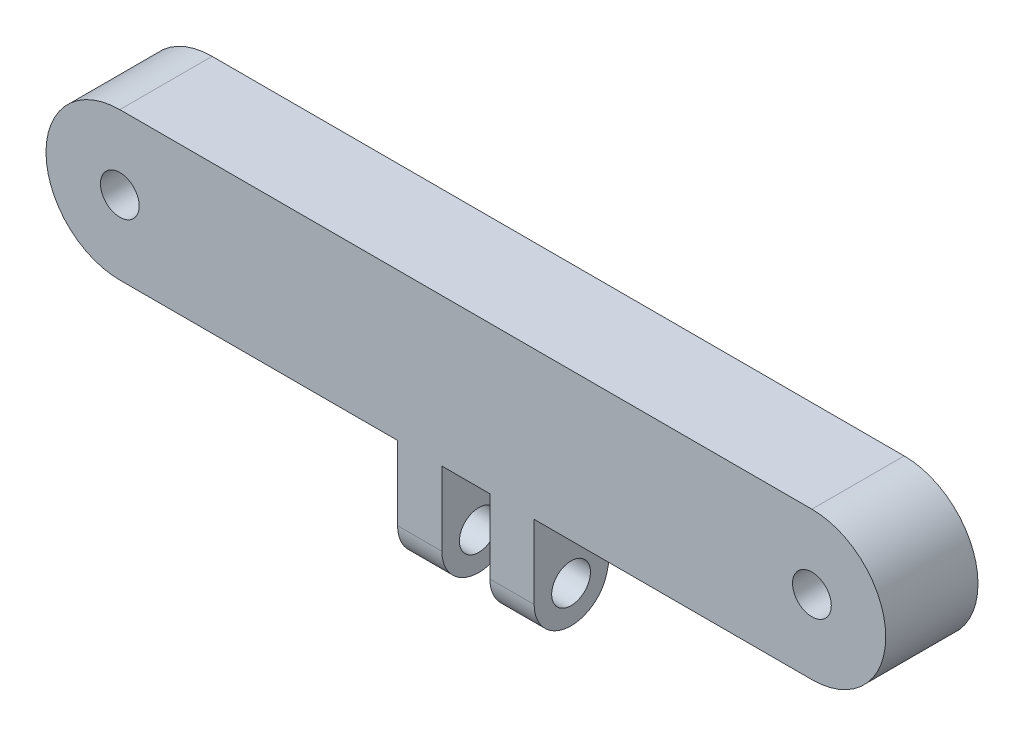
ISO-10303-21;
HEADER;
FILE_DESCRIPTION(('STEP AP214'),'2;1');
FILE_NAME('part.step','',(''),(''),'','','');
FILE_SCHEMA(('AUTOMOTIVE_DESIGN { 1 0 10303 214 1 1 1 1 }'));
ENDSEC;
DATA;
#1=APPLICATION_CONTEXT('core data for automotive mechanical design processes');
#2=APPLICATION_PROTOCOL_DEFINITION('international standard','automotive_design',2000,#1);
#3=PRODUCT_CONTEXT('',#1,'mechanical');
#4=PRODUCT('Part','Part','',(#3));
#5=PRODUCT_RELATED_PRODUCT_CATEGORY('part','',(#4));
#6=PRODUCT_DEFINITION_FORMATION('','',#4);
#7=PRODUCT_DEFINITION_CONTEXT('part definition',#1,'design');
#8=PRODUCT_DEFINITION('design','',#6,#7);
#9=PRODUCT_DEFINITION_SHAPE('','',#8);
#10=(LENGTH_UNIT() NAMED_UNIT(*) SI_UNIT(.MILLI.,.METRE.));
#11=(NAMED_UNIT(*) PLANE_ANGLE_UNIT() SI_UNIT($,.RADIAN.));
#12=(NAMED_UNIT(*) SI_UNIT($,.STERADIAN.) SOLID_ANGLE_UNIT());
#13=UNCERTAINTY_MEASURE_WITH_UNIT(LENGTH_MEASURE(1.E-05),#10,'distance_accuracy_value','');
#14=(GEOMETRIC_REPRESENTATION_CONTEXT(3) GLOBAL_UNCERTAINTY_ASSIGNED_CONTEXT((#13)) GLOBAL_UNIT_ASSIGNED_CONTEXT((#10,
#11,#12)) REPRESENTATION_CONTEXT('',''));
#15=CARTESIAN_POINT('',(0.,0.,0.));
#16=DIRECTION('',(0.,0.,1.));
#17=DIRECTION('',(1.,0.,0.));
#18=AXIS2_PLACEMENT_3D('',#15,#16,#17);
#19=CARTESIAN_POINT('',(7.4,-16.,6.));
#20=DIRECTION('',(-1.,0.,0.));
#21=DIRECTION('',(0.,0.,1.));
#22=AXIS2_PLACEMENT_3D('',#19,#20,#21);
#23=CYLINDRICAL_SURFACE('',#22,4.);
#24=DIRECTION('',(-1.,0.,0.));
#25=VECTOR('',#24,1.);
#26=CARTESIAN_POINT('',(7.4,-16.9196363335788,2.10715155522826));
#27=LINE('',#26,#25);
#28=CARTESIAN_POINT('',(-2.6,-16.9196363335788,2.10715155522826));
#29=VERTEX_POINT('',#28);
#30=CARTESIAN_POINT('',(-7.4,-16.9196363335788,2.10715155522826));
#31=VERTEX_POINT('',#30);
#32=EDGE_CURVE('E198',#29,#31,#27,.T.);
#33=ORIENTED_EDGE('',*,*,#32,.F.);
#34=CARTESIAN_POINT('',(-2.6,-16.,6.));
#35=DIRECTION('',(-1.,0.,0.));
#36=DIRECTION('',(0.,-1.,0.));
#37=AXIS2_PLACEMENT_3D('',#34,#35,#36);
#38=CIRCLE('',#37,4.);
#39=CARTESIAN_POINT('',(-2.6,-16.,10.));
#40=VERTEX_POINT('',#39);
#41=EDGE_CURVE('E330',#29,#40,#38,.T.);
#42=ORIENTED_EDGE('',*,*,#41,.T.);
#43=DIRECTION('',(-1.,0.,0.));
#44=VECTOR('',#43,1.);
#45=CARTESIAN_POINT('',(7.4,-16.,10.));
#46=LINE('',#45,#44);
#47=CARTESIAN_POINT('',(-7.4,-16.,10.));
#48=VERTEX_POINT('',#47);
#49=EDGE_CURVE('E210',#40,#48,#46,.T.);
#50=ORIENTED_EDGE('',*,*,#49,.T.);
#51=CARTESIAN_POINT('',(-7.4,-16.,6.));
#52=DIRECTION('',(1.,0.,0.));
#53=DIRECTION('',(0.,0.,-1.));
#54=AXIS2_PLACEMENT_3D('',#51,#52,#53);
#55=CIRCLE('',#54,4.);
#56=EDGE_CURVE('E361',#48,#31,#55,.T.);
#57=ORIENTED_EDGE('',*,*,#56,.T.);
#58=EDGE_LOOP('',(#33,#42,#50,#57));
#59=FACE_BOUND('',#58,.T.);
#60=ADVANCED_FACE('F45',(#59),#23,.T.);
#61=CARTESIAN_POINT('',(7.4,-16.9196363335788,2.10715155522826));
#62=DIRECTION('',(0.,0.229909083394701,0.973212111192934));
#63=DIRECTION('',(0.,-0.973212111192934,0.229909083394701));
#64=AXIS2_PLACEMENT_3D('',#61,#62,#63);
#65=PLANE('',#64);
#66=DIRECTION('',(-1.,0.,0.));
#67=VECTOR('',#66,1.);
#68=CARTESIAN_POINT('',(7.4,-7.99999999999999,0.));
#69=LINE('',#68,#67);
#70=CARTESIAN_POINT('',(-2.6,-7.99999999999999,0.));
#71=VERTEX_POINT('',#70);
#72=CARTESIAN_POINT('',(-7.4,-7.99999999999999,0.));
#73=VERTEX_POINT('',#72);
#74=EDGE_CURVE('E199',#71,#73,#69,.T.);
#75=ORIENTED_EDGE('',*,*,#74,.F.);
#76=DIRECTION('',(0.,-0.973212111192934,0.229909083394701));
#77=VECTOR('',#76,1.);
#78=CARTESIAN_POINT('',(-2.6,-16.9196363335788,2.10715155522826));
#79=LINE('',#78,#77);
#80=EDGE_CURVE('E326',#71,#29,#79,.T.);
#81=ORIENTED_EDGE('',*,*,#80,.T.);
#82=ORIENTED_EDGE('',*,*,#32,.T.);
#83=DIRECTION('',(0.,0.973212111192934,-0.229909083394701));
#84=VECTOR('',#83,1.);
#85=CARTESIAN_POINT('',(-7.4,-16.9196363335788,2.10715155522826));
#86=LINE('',#85,#84);
#87=EDGE_CURVE('E206',#31,#73,#86,.T.);
#88=ORIENTED_EDGE('',*,*,#87,.T.);
#89=EDGE_LOOP('',(#75,#81,#82,#88));
#90=FACE_BOUND('',#89,.T.);
#91=ADVANCED_FACE('F373',(#90),#65,.F.);
#92=CARTESIAN_POINT('',(7.4,-16.,6.));
#93=DIRECTION('',(-1.,0.,0.));
#94=DIRECTION('',(0.,0.,1.));
#95=AXIS2_PLACEMENT_3D('',#92,#93,#94);
#96=CYLINDRICAL_SURFACE('',#95,2.1);
#97=CARTESIAN_POINT('',(-2.6,-16.,6.));
#98=DIRECTION('',(-1.,0.,0.));
#99=DIRECTION('',(0.,-1.,0.));
#100=AXIS2_PLACEMENT_3D('',#97,#98,#99);
#101=CIRCLE('',#100,2.1);
#102=CARTESIAN_POINT('',(-2.6,-18.1,6.));
#103=VERTEX_POINT('',#102);
#104=EDGE_CURVE('E49',#103,#103,#101,.T.);
#105=ORIENTED_EDGE('',*,*,#104,.F.);
#106=EDGE_LOOP('',(#105));
#107=FACE_BOUND('',#106,.T.);
#108=CARTESIAN_POINT('',(-7.4,-16.,6.));
#109=DIRECTION('',(1.,0.,0.));
#110=DIRECTION('',(0.,0.,-1.));
#111=AXIS2_PLACEMENT_3D('',#108,#109,#110);
#112=CIRCLE('',#111,2.1);
#113=CARTESIAN_POINT('',(-7.4,-16.,3.9));
#114=VERTEX_POINT('',#113);
#115=EDGE_CURVE('E334',#114,#114,#112,.T.);
#116=ORIENTED_EDGE('',*,*,#115,.F.);
#117=EDGE_LOOP('',(#116));
#118=FACE_BOUND('',#117,.T.);
#119=ADVANCED_FACE('F417',(#107,#118),#96,.F.);
#120=CARTESIAN_POINT('',(-37.5,-8.,10.));
#121=DIRECTION('',(0.,1.,0.));
#122=DIRECTION('',(-1.,0.,0.));
#123=AXIS2_PLACEMENT_3D('',#120,#121,#122);
#124=PLANE('',#123);
#125=DIRECTION('',(0.,0.,1.));
#126=VECTOR('',#125,1.);
#127=CARTESIAN_POINT('',(-7.4,-7.99999999999999,0.));
#128=LINE('',#127,#126);
#129=CARTESIAN_POINT('',(-7.4,-7.99999999999999,10.));
#130=VERTEX_POINT('',#129);
#131=EDGE_CURVE('E339',#73,#130,#128,.T.);
#132=ORIENTED_EDGE('',*,*,#131,.T.);
#133=DIRECTION('',(1.,0.,0.));
#134=VECTOR('',#133,1.);
#135=CARTESIAN_POINT('',(-37.5,-8.,10.));
#136=LINE('',#135,#134);
#137=CARTESIAN_POINT('',(-37.5,-8.,10.));
#138=VERTEX_POINT('',#137);
#139=EDGE_CURVE('E282',#138,#130,#136,.T.);
#140=ORIENTED_EDGE('',*,*,#139,.F.);
#141=DIRECTION('',(0.,0.,-1.));
#142=VECTOR('',#141,1.);
#143=CARTESIAN_POINT('',(-37.5,-8.,10.));
#144=LINE('',#143,#142);
#145=CARTESIAN_POINT('',(-37.5,-8.,0.));
#146=VERTEX_POINT('',#145);
#147=EDGE_CURVE('E11',#138,#146,#144,.T.);
#148=ORIENTED_EDGE('',*,*,#147,.T.);
#149=DIRECTION('',(1.,0.,0.));
#150=VECTOR('',#149,1.);
#151=CARTESIAN_POINT('',(-37.5,-8.,0.));
#152=LINE('',#151,#150);
#153=EDGE_CURVE('E296',#146,#73,#152,.T.);
#154=ORIENTED_EDGE('',*,*,#153,.T.);
#155=EDGE_LOOP('',(#132,#140,#148,#154));
#156=FACE_BOUND('',#155,.T.);
#157=ADVANCED_FACE('F379',(#156),#124,.F.);
#158=CARTESIAN_POINT('',(-37.5,0.,10.));
#159=DIRECTION('',(0.,0.,1.));
#160=DIRECTION('',(1.,0.,0.));
#161=AXIS2_PLACEMENT_3D('',#158,#159,#160);
#162=PLANE('',#161);
#163=DIRECTION('',(0.,-1.,0.));
#164=VECTOR('',#163,1.);
#165=CARTESIAN_POINT('',(-2.6,-8.,10.));
#166=LINE('',#165,#164);
#167=CARTESIAN_POINT('',(-2.6,-8.,10.));
#168=VERTEX_POINT('',#167);
#169=EDGE_CURVE('E400',#168,#40,#166,.T.);
#170=ORIENTED_EDGE('',*,*,#169,.F.);
#171=DIRECTION('',(-1.,0.,0.));
#172=VECTOR('',#171,1.);
#173=CARTESIAN_POINT('',(-2.6,-8.,10.));
#174=LINE('',#173,#172);
#175=CARTESIAN_POINT('',(2.6,-8.,10.));
#176=VERTEX_POINT('',#175);
#177=EDGE_CURVE('E178',#176,#168,#174,.T.);
#178=ORIENTED_EDGE('',*,*,#177,.F.);
#179=DIRECTION('',(0.,1.,0.));
#180=VECTOR('',#179,1.);
#181=CARTESIAN_POINT('',(2.6,-8.,10.));
#182=LINE('',#181,#180);
#183=CARTESIAN_POINT('',(2.6,-16.,10.));
#184=VERTEX_POINT('',#183);
#185=EDGE_CURVE('E168',#184,#176,#182,.T.);
#186=ORIENTED_EDGE('',*,*,#185,.F.);
#187=CARTESIAN_POINT('',(7.4,-16.,10.));
#188=VERTEX_POINT('',#187);
#189=EDGE_CURVE('E211',#188,#184,#46,.T.);
#190=ORIENTED_EDGE('',*,*,#189,.F.);
#191=DIRECTION('',(0.,-1.,0.));
#192=VECTOR('',#191,1.);
#193=CARTESIAN_POINT('',(7.4,-7.99999999999999,10.));
#194=LINE('',#193,#192);
#195=CARTESIAN_POINT('',(7.4,-7.99999999999999,10.));
#196=VERTEX_POINT('',#195);
#197=EDGE_CURVE('E347',#196,#188,#194,.T.);
#198=ORIENTED_EDGE('',*,*,#197,.F.);
#199=CARTESIAN_POINT('',(37.5,-7.99999999999999,10.));
#200=VERTEX_POINT('',#199);
#201=EDGE_CURVE('E71',#196,#200,#136,.T.);
#202=ORIENTED_EDGE('',*,*,#201,.T.);
#203=CARTESIAN_POINT('',(37.5,0.,10.));
#204=DIRECTION('',(0.,0.,1.));
#205=DIRECTION('',(1.,0.,0.));
#206=AXIS2_PLACEMENT_3D('',#203,#204,#205);
#207=CIRCLE('',#206,8.);
#208=CARTESIAN_POINT('',(37.5,8.00000000000001,10.));
#209=VERTEX_POINT('',#208);
#210=EDGE_CURVE('E286',#200,#209,#207,.T.);
#211=ORIENTED_EDGE('',*,*,#210,.T.);
#212=DIRECTION('',(-1.,0.,0.));
#213=VECTOR('',#212,1.);
#214=CARTESIAN_POINT('',(-37.5,8.,10.));
#215=LINE('',#214,#213);
#216=CARTESIAN_POINT('',(-37.5,8.,10.));
#217=VERTEX_POINT('',#216);
#218=EDGE_CURVE('E289',#209,#217,#215,.T.);
#219=ORIENTED_EDGE('',*,*,#218,.T.);
#220=CARTESIAN_POINT('',(-37.5,0.,10.));
#221=DIRECTION('',(0.,0.,1.));
#222=DIRECTION('',(1.,0.,0.));
#223=AXIS2_PLACEMENT_3D('',#220,#221,#222);
#224=CIRCLE('',#223,8.);
#225=EDGE_CURVE('E277',#217,#138,#224,.T.);
#226=ORIENTED_EDGE('',*,*,#225,.T.);
#227=ORIENTED_EDGE('',*,*,#139,.T.);
#228=DIRECTION('',(0.,-1.,0.));
#229=VECTOR('',#228,1.);
#230=CARTESIAN_POINT('',(-7.4,-7.99999999999999,10.));
#231=LINE('',#230,#229);
#232=EDGE_CURVE('E358',#130,#48,#231,.T.);
#233=ORIENTED_EDGE('',*,*,#232,.T.);
#234=ORIENTED_EDGE('',*,*,#49,.F.);
#235=EDGE_LOOP('',(#170,#178,#186,#190,#198,#202,#211,#219,#226,#227,#233,#234));
#236=FACE_BOUND('',#235,.T.);
#237=CARTESIAN_POINT('',(-37.5,0.,10.));
#238=DIRECTION('',(0.,0.,1.));
#239=DIRECTION('',(1.,0.,0.));
#240=AXIS2_PLACEMENT_3D('',#237,#238,#239);
#241=CIRCLE('',#240,2.1);
#242=CARTESIAN_POINT('',(-35.4,0.,10.));
#243=VERTEX_POINT('',#242);
#244=EDGE_CURVE('E269',#243,#243,#241,.T.);
#245=ORIENTED_EDGE('',*,*,#244,.F.);
#246=EDGE_LOOP('',(#245));
#247=FACE_BOUND('',#246,.T.);
#248=CARTESIAN_POINT('',(37.5,0.,10.));
#249=DIRECTION('',(0.,0.,1.));
#250=DIRECTION('',(1.,0.,0.));
#251=AXIS2_PLACEMENT_3D('',#248,#249,#250);
#252=CIRCLE('',#251,2.1);
#253=CARTESIAN_POINT('',(39.6,0.,10.));
#254=VERTEX_POINT('',#253);
#255=EDGE_CURVE('E261',#254,#254,#252,.T.);
#256=ORIENTED_EDGE('',*,*,#255,.F.);
#257=EDGE_LOOP('',(#256));
#258=FACE_BOUND('',#257,.T.);
#259=ADVANCED_FACE('F382',(#236,#247,#258),#162,.T.);
#260=CARTESIAN_POINT('',(-37.5,0.,0.));
#261=DIRECTION('',(0.,0.,1.));
#262=DIRECTION('',(1.,0.,0.));
#263=AXIS2_PLACEMENT_3D('',#260,#261,#262);
#264=PLANE('',#263);
#265=CARTESIAN_POINT('',(37.5,0.,0.));
#266=DIRECTION('',(0.,0.,1.));
#267=DIRECTION('',(1.,0.,0.));
#268=AXIS2_PLACEMENT_3D('',#265,#266,#267);
#269=CIRCLE('',#268,5.1);
#270=CARTESIAN_POINT('',(36.4950124378879,5.00000000000001,0.));
#271=VERTEX_POINT('',#270);
#272=CARTESIAN_POINT('',(36.4950124378879,-4.99999999999999,0.));
#273=VERTEX_POINT('',#272);
#274=EDGE_CURVE('E215',#271,#273,#269,.T.);
#275=ORIENTED_EDGE('',*,*,#274,.F.);
#276=DIRECTION('',(-1.,0.,0.));
#277=VECTOR('',#276,1.);
#278=CARTESIAN_POINT('',(-37.5,5.,0.));
#279=LINE('',#278,#277);
#280=CARTESIAN_POINT('',(-36.4950124378879,5.,0.));
#281=VERTEX_POINT('',#280);
#282=EDGE_CURVE('E227',#271,#281,#279,.T.);
#283=ORIENTED_EDGE('',*,*,#282,.T.);
#284=CARTESIAN_POINT('',(-37.5,0.,0.));
#285=DIRECTION('',(0.,0.,1.));
#286=DIRECTION('',(1.,0.,0.));
#287=AXIS2_PLACEMENT_3D('',#284,#285,#286);
#288=CIRCLE('',#287,5.1);
#289=CARTESIAN_POINT('',(-36.4950124378879,-5.,0.));
#290=VERTEX_POINT('',#289);
#291=EDGE_CURVE('E221',#290,#281,#288,.T.);
#292=ORIENTED_EDGE('',*,*,#291,.F.);
#293=DIRECTION('',(1.,0.,0.));
#294=VECTOR('',#293,1.);
#295=CARTESIAN_POINT('',(-37.5,-5.,0.));
#296=LINE('',#295,#294);
#297=EDGE_CURVE('E220',#290,#273,#296,.T.);
#298=ORIENTED_EDGE('',*,*,#297,.T.);
#299=EDGE_LOOP('',(#275,#283,#292,#298));
#300=FACE_BOUND('',#299,.T.);
#301=CARTESIAN_POINT('',(-37.5,0.,0.));
#302=DIRECTION('',(0.,0.,1.));
#303=DIRECTION('',(1.,0.,0.));
#304=AXIS2_PLACEMENT_3D('',#301,#302,#303);
#305=CIRCLE('',#304,8.);
#306=CARTESIAN_POINT('',(-37.5,8.,0.));
#307=VERTEX_POINT('',#306);
#308=EDGE_CURVE('E273',#307,#146,#305,.T.);
#309=ORIENTED_EDGE('',*,*,#308,.F.);
#310=DIRECTION('',(-1.,0.,0.));
#311=VECTOR('',#310,1.);
#312=CARTESIAN_POINT('',(-37.5,8.,0.));
#313=LINE('',#312,#311);
#314=CARTESIAN_POINT('',(37.5,8.00000000000001,0.));
#315=VERTEX_POINT('',#314);
#316=EDGE_CURVE('E281',#315,#307,#313,.T.);
#317=ORIENTED_EDGE('',*,*,#316,.F.);
#318=CARTESIAN_POINT('',(37.5,0.,0.));
#319=DIRECTION('',(0.,0.,1.));
#320=DIRECTION('',(1.,0.,0.));
#321=AXIS2_PLACEMENT_3D('',#318,#319,#320);
#322=CIRCLE('',#321,8.);
#323=CARTESIAN_POINT('',(37.5,-7.99999999999999,0.));
#324=VERTEX_POINT('',#323);
#325=EDGE_CURVE('E300',#324,#315,#322,.T.);
#326=ORIENTED_EDGE('',*,*,#325,.F.);
#327=CARTESIAN_POINT('',(7.4,-7.99999999999999,0.));
#328=VERTEX_POINT('',#327);
#329=EDGE_CURVE('E196',#328,#324,#152,.T.);
#330=ORIENTED_EDGE('',*,*,#329,.F.);
#331=CARTESIAN_POINT('',(2.6,-8.,0.));
#332=VERTEX_POINT('',#331);
#333=EDGE_CURVE('E185',#328,#332,#69,.T.);
#334=ORIENTED_EDGE('',*,*,#333,.T.);
#335=DIRECTION('',(-1.,0.,0.));
#336=VECTOR('',#335,1.);
#337=CARTESIAN_POINT('',(-2.6,-8.,0.));
#338=LINE('',#337,#336);
#339=EDGE_CURVE('E171',#332,#71,#338,.T.);
#340=ORIENTED_EDGE('',*,*,#339,.T.);
#341=ORIENTED_EDGE('',*,*,#74,.T.);
#342=ORIENTED_EDGE('',*,*,#153,.F.);
#343=EDGE_LOOP('',(#309,#317,#326,#330,#334,#340,#341,#342));
#344=FACE_BOUND('',#343,.T.);
#345=CARTESIAN_POINT('',(-37.5,0.,0.));
#346=DIRECTION('',(0.,0.,1.));
#347=DIRECTION('',(1.,0.,0.));
#348=AXIS2_PLACEMENT_3D('',#345,#346,#347);
#349=CIRCLE('',#348,2.1);
#350=CARTESIAN_POINT('',(-35.4,0.,0.));
#351=VERTEX_POINT('',#350);
#352=EDGE_CURVE('E265',#351,#351,#349,.T.);
#353=ORIENTED_EDGE('',*,*,#352,.T.);
#354=EDGE_LOOP('',(#353));
#355=FACE_BOUND('',#354,.T.);
#356=CARTESIAN_POINT('',(37.5,0.,0.));
#357=DIRECTION('',(0.,0.,1.));
#358=DIRECTION('',(1.,0.,0.));
#359=AXIS2_PLACEMENT_3D('',#356,#357,#358);
#360=CIRCLE('',#359,2.1);
#361=CARTESIAN_POINT('',(39.6,0.,0.));
#362=VERTEX_POINT('',#361);
#363=EDGE_CURVE('E260',#362,#362,#360,.T.);
#364=ORIENTED_EDGE('',*,*,#363,.T.);
#365=EDGE_LOOP('',(#364));
#366=FACE_BOUND('',#365,.T.);
#367=ADVANCED_FACE('F193',(#300,#344,#355,#366),#264,.F.);
#368=CARTESIAN_POINT('',(-37.5,0.,10.));
#369=DIRECTION('',(0.,0.,-1.));
#370=DIRECTION('',(-1.,0.,0.));
#371=AXIS2_PLACEMENT_3D('',#368,#369,#370);
#372=CYLINDRICAL_SURFACE('',#371,8.);
#373=ORIENTED_EDGE('',*,*,#308,.T.);
#374=ORIENTED_EDGE('',*,*,#147,.F.);
#375=ORIENTED_EDGE('',*,*,#225,.F.);
#376=DIRECTION('',(0.,0.,-1.));
#377=VECTOR('',#376,1.);
#378=CARTESIAN_POINT('',(-37.5,8.,10.));
#379=LINE('',#378,#377);
#380=EDGE_CURVE('E292',#217,#307,#379,.T.);
#381=ORIENTED_EDGE('',*,*,#380,.T.);
#382=EDGE_LOOP('',(#373,#374,#375,#381));
#383=FACE_BOUND('',#382,.T.);
#384=ADVANCED_FACE('F47',(#383),#372,.T.);
#385=ORIENTED_EDGE('',*,*,#201,.F.);
#386=DIRECTION('',(0.,0.,1.));
#387=VECTOR('',#386,1.);
#388=CARTESIAN_POINT('',(7.4,-7.99999999999999,0.));
#389=LINE('',#388,#387);
#390=EDGE_CURVE('E343',#328,#196,#389,.T.);
#391=ORIENTED_EDGE('',*,*,#390,.F.);
#392=ORIENTED_EDGE('',*,*,#329,.T.);
#393=DIRECTION('',(0.,0.,-1.));
#394=VECTOR('',#393,1.);
#395=CARTESIAN_POINT('',(37.5,-7.99999999999999,10.));
#396=LINE('',#395,#394);
#397=EDGE_CURVE('E55',#200,#324,#396,.T.);
#398=ORIENTED_EDGE('',*,*,#397,.F.);
#399=EDGE_LOOP('',(#385,#391,#392,#398));
#400=FACE_BOUND('',#399,.T.);
#401=ADVANCED_FACE('F397',(#400),#124,.F.);
#402=CARTESIAN_POINT('',(37.5,0.,10.));
#403=DIRECTION('',(0.,0.,-1.));
#404=DIRECTION('',(-1.,0.,0.));
#405=AXIS2_PLACEMENT_3D('',#402,#403,#404);
#406=CYLINDRICAL_SURFACE('',#405,8.);
#407=ORIENTED_EDGE('',*,*,#325,.T.);
#408=DIRECTION('',(0.,0.,-1.));
#409=VECTOR('',#408,1.);
#410=CARTESIAN_POINT('',(37.5,8.00000000000001,10.));
#411=LINE('',#410,#409);
#412=EDGE_CURVE('E308',#209,#315,#411,.T.);
#413=ORIENTED_EDGE('',*,*,#412,.F.);
#414=ORIENTED_EDGE('',*,*,#210,.F.);
#415=ORIENTED_EDGE('',*,*,#397,.T.);
#416=EDGE_LOOP('',(#407,#413,#414,#415));
#417=FACE_BOUND('',#416,.T.);
#418=ADVANCED_FACE('F396',(#417),#406,.T.);
#419=CARTESIAN_POINT('',(-37.5,8.,10.));
#420=DIRECTION('',(0.,-1.,0.));
#421=DIRECTION('',(1.,0.,0.));
#422=AXIS2_PLACEMENT_3D('',#419,#420,#421);
#423=PLANE('',#422);
#424=ORIENTED_EDGE('',*,*,#316,.T.);
#425=ORIENTED_EDGE('',*,*,#380,.F.);
#426=ORIENTED_EDGE('',*,*,#218,.F.);
#427=ORIENTED_EDGE('',*,*,#412,.T.);
#428=EDGE_LOOP('',(#424,#425,#426,#427));
#429=FACE_BOUND('',#428,.T.);
#430=ADVANCED_FACE('F392',(#429),#423,.F.);
#431=CARTESIAN_POINT('',(-37.5,0.,10.));
#432=DIRECTION('',(0.,0.,-1.));
#433=DIRECTION('',(-1.,0.,0.));
#434=AXIS2_PLACEMENT_3D('',#431,#432,#433);
#435=CYLINDRICAL_SURFACE('',#434,2.1);
#436=ORIENTED_EDGE('',*,*,#244,.T.);
#437=EDGE_LOOP('',(#436));
#438=FACE_BOUND('',#437,.T.);
#439=ORIENTED_EDGE('',*,*,#352,.F.);
#440=EDGE_LOOP('',(#439));
#441=FACE_BOUND('',#440,.T.);
#442=ADVANCED_FACE('F466',(#438,#441),#435,.F.);
#443=CARTESIAN_POINT('',(37.5,0.,10.));
#444=DIRECTION('',(0.,0.,-1.));
#445=DIRECTION('',(-1.,0.,0.));
#446=AXIS2_PLACEMENT_3D('',#443,#444,#445);
#447=CYLINDRICAL_SURFACE('',#446,2.1);
#448=ORIENTED_EDGE('',*,*,#255,.T.);
#449=EDGE_LOOP('',(#448));
#450=FACE_BOUND('',#449,.T.);
#451=ORIENTED_EDGE('',*,*,#363,.F.);
#452=EDGE_LOOP('',(#451));
#453=FACE_BOUND('',#452,.T.);
#454=ADVANCED_FACE('F462',(#450,#453),#447,.F.);
#455=CARTESIAN_POINT('',(-37.5,0.,7.));
#456=DIRECTION('',(0.,0.,1.));
#457=DIRECTION('',(1.,0.,0.));
#458=AXIS2_PLACEMENT_3D('',#455,#456,#457);
#459=PLANE('',#458);
#460=DIRECTION('',(1.,0.,0.));
#461=VECTOR('',#460,1.);
#462=CARTESIAN_POINT('',(-37.5,-5.,7.));
#463=LINE('',#462,#461);
#464=CARTESIAN_POINT('',(-36.4950124378879,-5.,7.));
#465=VERTEX_POINT('',#464);
#466=CARTESIAN_POINT('',(36.4950124378879,-4.99999999999999,7.));
#467=VERTEX_POINT('',#466);
#468=EDGE_CURVE('E222',#465,#467,#463,.T.);
#469=ORIENTED_EDGE('',*,*,#468,.F.);
#470=CARTESIAN_POINT('',(-37.5,0.,7.));
#471=DIRECTION('',(0.,0.,1.));
#472=DIRECTION('',(1.,0.,0.));
#473=AXIS2_PLACEMENT_3D('',#470,#471,#472);
#474=CIRCLE('',#473,5.1);
#475=CARTESIAN_POINT('',(-36.4950124378879,5.,7.));
#476=VERTEX_POINT('',#475);
#477=EDGE_CURVE('E216',#465,#476,#474,.T.);
#478=ORIENTED_EDGE('',*,*,#477,.T.);
#479=DIRECTION('',(-1.,0.,0.));
#480=VECTOR('',#479,1.);
#481=CARTESIAN_POINT('',(-37.5,5.,7.));
#482=LINE('',#481,#480);
#483=CARTESIAN_POINT('',(36.4950124378879,5.00000000000001,7.));
#484=VERTEX_POINT('',#483);
#485=EDGE_CURVE('E226',#484,#476,#482,.T.);
#486=ORIENTED_EDGE('',*,*,#485,.F.);
#487=CARTESIAN_POINT('',(37.5,0.,7.));
#488=DIRECTION('',(0.,0.,1.));
#489=DIRECTION('',(1.,0.,0.));
#490=AXIS2_PLACEMENT_3D('',#487,#488,#489);
#491=CIRCLE('',#490,5.1);
#492=EDGE_CURVE('E232',#484,#467,#491,.T.);
#493=ORIENTED_EDGE('',*,*,#492,.T.);
#494=EDGE_LOOP('',(#469,#478,#486,#493));
#495=FACE_BOUND('',#494,.T.);
#496=ADVANCED_FACE('F465',(#495),#459,.F.);
#497=CARTESIAN_POINT('',(-37.5,-5.,10.));
#498=DIRECTION('',(0.,1.,0.));
#499=DIRECTION('',(-1.,0.,0.));
#500=AXIS2_PLACEMENT_3D('',#497,#498,#499);
#501=PLANE('',#500);
#502=ORIENTED_EDGE('',*,*,#468,.T.);
#503=DIRECTION('',(0.,0.,-1.));
#504=VECTOR('',#503,1.);
#505=CARTESIAN_POINT('',(36.4950124378879,-4.99999999999999,10.));
#506=LINE('',#505,#504);
#507=EDGE_CURVE('E250',#467,#273,#506,.T.);
#508=ORIENTED_EDGE('',*,*,#507,.T.);
#509=ORIENTED_EDGE('',*,*,#297,.F.);
#510=DIRECTION('',(0.,0.,-1.));
#511=VECTOR('',#510,1.);
#512=CARTESIAN_POINT('',(-36.4950124378879,-5.,10.));
#513=LINE('',#512,#511);
#514=EDGE_CURVE('E256',#465,#290,#513,.T.);
#515=ORIENTED_EDGE('',*,*,#514,.F.);
#516=EDGE_LOOP('',(#502,#508,#509,#515));
#517=FACE_BOUND('',#516,.T.);
#518=ADVANCED_FACE('F603',(#517),#501,.T.);
#519=CARTESIAN_POINT('',(-37.5,5.,10.));
#520=DIRECTION('',(0.,-1.,0.));
#521=DIRECTION('',(1.,0.,0.));
#522=AXIS2_PLACEMENT_3D('',#519,#520,#521);
#523=PLANE('',#522);
#524=DIRECTION('',(0.,0.,-1.));
#525=VECTOR('',#524,1.);
#526=CARTESIAN_POINT('',(-36.4950124378879,5.,10.));
#527=LINE('',#526,#525);
#528=EDGE_CURVE('E253',#476,#281,#527,.T.);
#529=ORIENTED_EDGE('',*,*,#528,.T.);
#530=ORIENTED_EDGE('',*,*,#282,.F.);
#531=DIRECTION('',(0.,0.,-1.));
#532=VECTOR('',#531,1.);
#533=CARTESIAN_POINT('',(36.4950124378879,5.00000000000001,10.));
#534=LINE('',#533,#532);
#535=EDGE_CURVE('E231',#484,#271,#534,.T.);
#536=ORIENTED_EDGE('',*,*,#535,.F.);
#537=ORIENTED_EDGE('',*,*,#485,.T.);
#538=EDGE_LOOP('',(#529,#530,#536,#537));
#539=FACE_BOUND('',#538,.T.);
#540=ADVANCED_FACE('F456',(#539),#523,.T.);
#541=CARTESIAN_POINT('',(-37.5,0.,10.));
#542=DIRECTION('',(0.,0.,-1.));
#543=DIRECTION('',(-1.,0.,0.));
#544=AXIS2_PLACEMENT_3D('',#541,#542,#543);
#545=CYLINDRICAL_SURFACE('',#544,5.1);
#546=ORIENTED_EDGE('',*,*,#514,.T.);
#547=ORIENTED_EDGE('',*,*,#291,.T.);
#548=ORIENTED_EDGE('',*,*,#528,.F.);
#549=ORIENTED_EDGE('',*,*,#477,.F.);
#550=EDGE_LOOP('',(#546,#547,#548,#549));
#551=FACE_BOUND('',#550,.T.);
#552=ADVANCED_FACE('F449',(#551),#545,.T.);
#553=CARTESIAN_POINT('',(37.5,0.,10.));
#554=DIRECTION('',(0.,0.,-1.));
#555=DIRECTION('',(-1.,0.,0.));
#556=AXIS2_PLACEMENT_3D('',#553,#554,#555);
#557=CYLINDRICAL_SURFACE('',#556,5.1);
#558=ORIENTED_EDGE('',*,*,#492,.F.);
#559=ORIENTED_EDGE('',*,*,#535,.T.);
#560=ORIENTED_EDGE('',*,*,#274,.T.);
#561=ORIENTED_EDGE('',*,*,#507,.F.);
#562=EDGE_LOOP('',(#558,#559,#560,#561));
#563=FACE_BOUND('',#562,.T.);
#564=ADVANCED_FACE('F441',(#563),#557,.T.);
#565=CARTESIAN_POINT('',(7.4,-16.,6.));
#566=DIRECTION('',(1.,0.,0.));
#567=DIRECTION('',(0.,0.,-1.));
#568=AXIS2_PLACEMENT_3D('',#565,#566,#567);
#569=PLANE('',#568);
#570=ORIENTED_EDGE('',*,*,#390,.T.);
#571=ORIENTED_EDGE('',*,*,#197,.T.);
#572=CARTESIAN_POINT('',(7.4,-16.,6.));
#573=DIRECTION('',(1.,0.,0.));
#574=DIRECTION('',(0.,0.,-1.));
#575=AXIS2_PLACEMENT_3D('',#572,#573,#574);
#576=CIRCLE('',#575,4.);
#577=CARTESIAN_POINT('',(7.4,-16.9196363335788,2.10715155522826));
#578=VERTEX_POINT('',#577);
#579=EDGE_CURVE('E350',#188,#578,#576,.T.);
#580=ORIENTED_EDGE('',*,*,#579,.T.);
#581=DIRECTION('',(0.,0.973212111192934,-0.229909083394701));
#582=VECTOR('',#581,1.);
#583=CARTESIAN_POINT('',(7.4,-16.9196363335788,2.10715155522826));
#584=LINE('',#583,#582);
#585=EDGE_CURVE('E204',#578,#328,#584,.T.);
#586=ORIENTED_EDGE('',*,*,#585,.T.);
#587=EDGE_LOOP('',(#570,#571,#580,#586));
#588=FACE_BOUND('',#587,.T.);
#589=CARTESIAN_POINT('',(7.4,-16.,6.));
#590=DIRECTION('',(1.,0.,0.));
#591=DIRECTION('',(0.,0.,-1.));
#592=AXIS2_PLACEMENT_3D('',#589,#590,#591);
#593=CIRCLE('',#592,2.1);
#594=CARTESIAN_POINT('',(7.4,-16.,3.9));
#595=VERTEX_POINT('',#594);
#596=EDGE_CURVE('E335',#595,#595,#593,.T.);
#597=ORIENTED_EDGE('',*,*,#596,.F.);
#598=EDGE_LOOP('',(#597));
#599=FACE_BOUND('',#598,.T.);
#600=ADVANCED_FACE('F434',(#588,#599),#569,.T.);
#601=CARTESIAN_POINT('',(-7.4,-16.,6.));
#602=DIRECTION('',(1.,0.,0.));
#603=DIRECTION('',(0.,0.,-1.));
#604=AXIS2_PLACEMENT_3D('',#601,#602,#603);
#605=PLANE('',#604);
#606=ORIENTED_EDGE('',*,*,#131,.F.);
#607=ORIENTED_EDGE('',*,*,#87,.F.);
#608=ORIENTED_EDGE('',*,*,#56,.F.);
#609=ORIENTED_EDGE('',*,*,#232,.F.);
#610=EDGE_LOOP('',(#606,#607,#608,#609));
#611=FACE_BOUND('',#610,.T.);
#612=ORIENTED_EDGE('',*,*,#115,.T.);
#613=EDGE_LOOP('',(#612));
#614=FACE_BOUND('',#613,.T.);
#615=ADVANCED_FACE('F376',(#611,#614),#605,.F.);
#616=ORIENTED_EDGE('',*,*,#189,.T.);
#617=CARTESIAN_POINT('',(2.6,-16.,6.));
#618=DIRECTION('',(1.,0.,0.));
#619=DIRECTION('',(0.,1.,0.));
#620=AXIS2_PLACEMENT_3D('',#617,#618,#619);
#621=CIRCLE('',#620,4.);
#622=CARTESIAN_POINT('',(2.6,-16.9196363335788,2.10715155522826));
#623=VERTEX_POINT('',#622);
#624=EDGE_CURVE('E189',#184,#623,#621,.T.);
#625=ORIENTED_EDGE('',*,*,#624,.T.);
#626=EDGE_CURVE('E187',#578,#623,#27,.T.);
#627=ORIENTED_EDGE('',*,*,#626,.F.);
#628=ORIENTED_EDGE('',*,*,#579,.F.);
#629=EDGE_LOOP('',(#616,#625,#627,#628));
#630=FACE_BOUND('',#629,.T.);
#631=ADVANCED_FACE('F421',(#630),#23,.T.);
#632=ORIENTED_EDGE('',*,*,#626,.T.);
#633=DIRECTION('',(0.,0.973212111192934,-0.229909083394701));
#634=VECTOR('',#633,1.);
#635=CARTESIAN_POINT('',(2.6,-16.9196363335788,2.10715155522826));
#636=LINE('',#635,#634);
#637=EDGE_CURVE('E165',#623,#332,#636,.T.);
#638=ORIENTED_EDGE('',*,*,#637,.T.);
#639=ORIENTED_EDGE('',*,*,#333,.F.);
#640=ORIENTED_EDGE('',*,*,#585,.F.);
#641=EDGE_LOOP('',(#632,#638,#639,#640));
#642=FACE_BOUND('',#641,.T.);
#643=ADVANCED_FACE('F183',(#642),#65,.F.);
#644=CARTESIAN_POINT('',(2.6,-16.,6.));
#645=DIRECTION('',(1.,0.,0.));
#646=DIRECTION('',(0.,1.,0.));
#647=AXIS2_PLACEMENT_3D('',#644,#645,#646);
#648=CIRCLE('',#647,2.1);
#649=CARTESIAN_POINT('',(2.6,-13.9,6.));
#650=VERTEX_POINT('',#649);
#651=EDGE_CURVE('E190',#650,#650,#648,.T.);
#652=ORIENTED_EDGE('',*,*,#651,.F.);
#653=EDGE_LOOP('',(#652));
#654=FACE_BOUND('',#653,.T.);
#655=ORIENTED_EDGE('',*,*,#596,.T.);
#656=EDGE_LOOP('',(#655));
#657=FACE_BOUND('',#656,.T.);
#658=ADVANCED_FACE('F407',(#654,#657),#96,.F.);
#659=CARTESIAN_POINT('',(-2.6,-8.,0.));
#660=DIRECTION('',(-1.,0.,0.));
#661=DIRECTION('',(0.,-1.,0.));
#662=AXIS2_PLACEMENT_3D('',#659,#660,#661);
#663=PLANE('',#662);
#664=ORIENTED_EDGE('',*,*,#104,.T.);
#665=EDGE_LOOP('',(#664));
#666=FACE_BOUND('',#665,.T.);
#667=ORIENTED_EDGE('',*,*,#80,.F.);
#668=DIRECTION('',(0.,0.,1.));
#669=VECTOR('',#668,1.);
#670=CARTESIAN_POINT('',(-2.6,-8.,0.));
#671=LINE('',#670,#669);
#672=EDGE_CURVE('E63',#71,#168,#671,.T.);
#673=ORIENTED_EDGE('',*,*,#672,.T.);
#674=ORIENTED_EDGE('',*,*,#169,.T.);
#675=ORIENTED_EDGE('',*,*,#41,.F.);
#676=EDGE_LOOP('',(#667,#673,#674,#675));
#677=FACE_BOUND('',#676,.T.);
#678=ADVANCED_FACE('F405',(#666,#677),#663,.F.);
#679=CARTESIAN_POINT('',(2.6,-8.,0.));
#680=DIRECTION('',(1.,0.,0.));
#681=DIRECTION('',(0.,1.,0.));
#682=AXIS2_PLACEMENT_3D('',#679,#680,#681);
#683=PLANE('',#682);
#684=ORIENTED_EDGE('',*,*,#651,.T.);
#685=EDGE_LOOP('',(#684));
#686=FACE_BOUND('',#685,.T.);
#687=ORIENTED_EDGE('',*,*,#185,.T.);
#688=DIRECTION('',(0.,0.,1.));
#689=VECTOR('',#688,1.);
#690=CARTESIAN_POINT('',(2.6,-8.,0.));
#691=LINE('',#690,#689);
#692=EDGE_CURVE('E162',#332,#176,#691,.T.);
#693=ORIENTED_EDGE('',*,*,#692,.F.);
#694=ORIENTED_EDGE('',*,*,#637,.F.);
#695=ORIENTED_EDGE('',*,*,#624,.F.);
#696=EDGE_LOOP('',(#687,#693,#694,#695));
#697=FACE_BOUND('',#696,.T.);
#698=ADVANCED_FACE('F163',(#686,#697),#683,.F.);
#699=CARTESIAN_POINT('',(-2.6,-8.,0.));
#700=DIRECTION('',(0.,1.,0.));
#701=DIRECTION('',(0.,0.,1.));
#702=AXIS2_PLACEMENT_3D('',#699,#700,#701);
#703=PLANE('',#702);
#704=ORIENTED_EDGE('',*,*,#177,.T.);
#705=ORIENTED_EDGE('',*,*,#672,.F.);
#706=ORIENTED_EDGE('',*,*,#339,.F.);
#707=ORIENTED_EDGE('',*,*,#692,.T.);
#708=EDGE_LOOP('',(#704,#705,#706,#707));
#709=FACE_BOUND('',#708,.T.);
#710=ADVANCED_FACE('F174',(#709),#703,.F.);
#711=CLOSED_SHELL('',(#60,#91,#119,#157,#259,#367,#384,#401,#418,#430,#442,#454,#496,#518,#540,
#552,#564,#600,#615,#631,#643,#658,#678,#698,#710));
#712=MANIFOLD_SOLID_BREP('B2',#711);
#713=ADVANCED_BREP_SHAPE_REPRESENTATION('',(#18,#712),#14);
#714=SHAPE_DEFINITION_REPRESENTATION(#9,#713);
ENDSEC;
END-ISO-10303-21;
